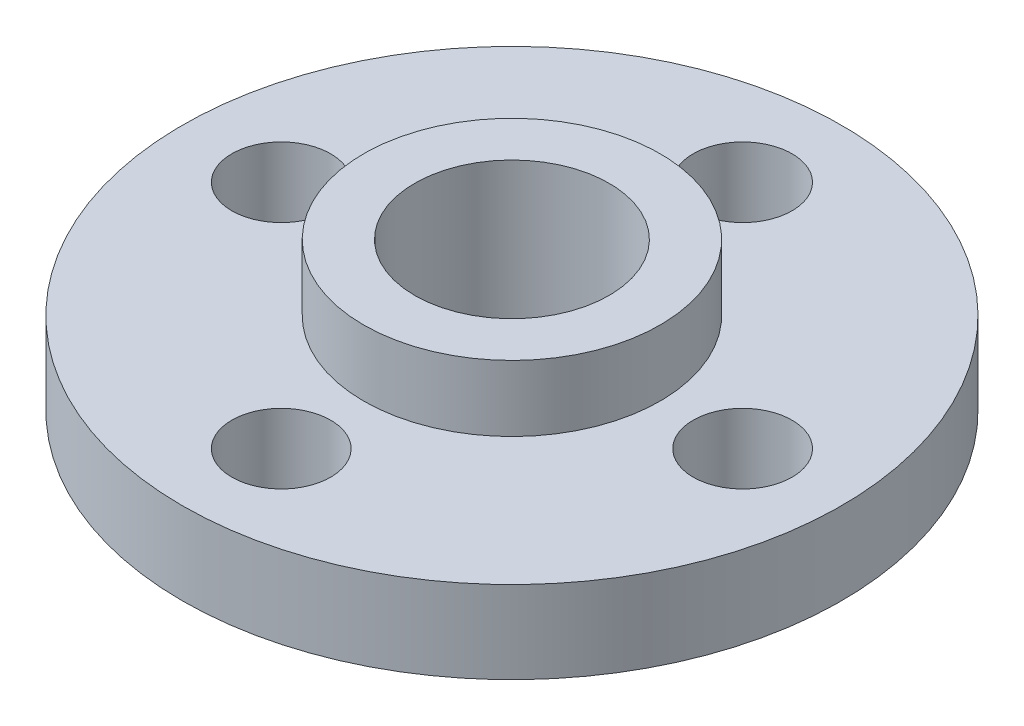
ISO-10303-21;
HEADER;
FILE_DESCRIPTION(('STEP AP214'),'2;1');
FILE_NAME('part.step','',(''),(''),'','','');
FILE_SCHEMA(('AUTOMOTIVE_DESIGN { 1 0 10303 214 1 1 1 1 }'));
ENDSEC;
DATA;
#1=APPLICATION_CONTEXT('core data for automotive mechanical design processes');
#2=APPLICATION_PROTOCOL_DEFINITION('international standard','automotive_design',2000,#1);
#3=PRODUCT_CONTEXT('',#1,'mechanical');
#4=PRODUCT('Part','Part','',(#3));
#5=PRODUCT_RELATED_PRODUCT_CATEGORY('part','',(#4));
#6=PRODUCT_DEFINITION_FORMATION('','',#4);
#7=PRODUCT_DEFINITION_CONTEXT('part definition',#1,'design');
#8=PRODUCT_DEFINITION('design','',#6,#7);
#9=PRODUCT_DEFINITION_SHAPE('','',#8);
#10=(LENGTH_UNIT() NAMED_UNIT(*) SI_UNIT(.MILLI.,.METRE.));
#11=(NAMED_UNIT(*) PLANE_ANGLE_UNIT() SI_UNIT($,.RADIAN.));
#12=(NAMED_UNIT(*) SI_UNIT($,.STERADIAN.) SOLID_ANGLE_UNIT());
#13=UNCERTAINTY_MEASURE_WITH_UNIT(LENGTH_MEASURE(1.E-05),#10,'distance_accuracy_value','');
#14=(GEOMETRIC_REPRESENTATION_CONTEXT(3) GLOBAL_UNCERTAINTY_ASSIGNED_CONTEXT((#13)) GLOBAL_UNIT_ASSIGNED_CONTEXT((#10,
#11,#12)) REPRESENTATION_CONTEXT('',''));
#15=CARTESIAN_POINT('',(0.,0.,0.));
#16=DIRECTION('',(0.,0.,1.));
#17=DIRECTION('',(1.,0.,0.));
#18=AXIS2_PLACEMENT_3D('',#15,#16,#17);
#19=CARTESIAN_POINT('',(0.,2.5,0.));
#20=DIRECTION('',(0.,1.,0.));
#21=DIRECTION('',(0.,0.,1.));
#22=AXIS2_PLACEMENT_3D('',#19,#20,#21);
#23=PLANE('',#22);
#24=CARTESIAN_POINT('',(0.,2.5,7.));
#25=DIRECTION('',(0.,1.,0.));
#26=DIRECTION('',(0.,0.,1.));
#27=AXIS2_PLACEMENT_3D('',#24,#25,#26);
#28=CIRCLE('',#27,1.5);
#29=CARTESIAN_POINT('',(0.,2.5,8.5));
#30=VERTEX_POINT('',#29);
#31=EDGE_CURVE('E54',#30,#30,#28,.T.);
#32=ORIENTED_EDGE('',*,*,#31,.F.);
#33=EDGE_LOOP('',(#32));
#34=FACE_BOUND('',#33,.T.);
#35=CARTESIAN_POINT('',(-7.,2.5,0.));
#36=DIRECTION('',(0.,1.,0.));
#37=DIRECTION('',(0.,0.,1.));
#38=AXIS2_PLACEMENT_3D('',#35,#36,#37);
#39=CIRCLE('',#38,1.5);
#40=CARTESIAN_POINT('',(-7.,2.5,1.5));
#41=VERTEX_POINT('',#40);
#42=EDGE_CURVE('E43',#41,#41,#39,.T.);
#43=ORIENTED_EDGE('',*,*,#42,.F.);
#44=EDGE_LOOP('',(#43));
#45=FACE_BOUND('',#44,.T.);
#46=CARTESIAN_POINT('',(0.,2.5,0.));
#47=DIRECTION('',(0.,1.,0.));
#48=DIRECTION('',(0.,0.,1.));
#49=AXIS2_PLACEMENT_3D('',#46,#47,#48);
#50=CIRCLE('',#49,10.);
#51=CARTESIAN_POINT('',(0.,2.5,10.));
#52=VERTEX_POINT('',#51);
#53=EDGE_CURVE('E10',#52,#52,#50,.T.);
#54=ORIENTED_EDGE('',*,*,#53,.T.);
#55=EDGE_LOOP('',(#54));
#56=FACE_BOUND('',#55,.T.);
#57=CARTESIAN_POINT('',(0.,2.5,-7.));
#58=DIRECTION('',(0.,1.,0.));
#59=DIRECTION('',(0.,0.,1.));
#60=AXIS2_PLACEMENT_3D('',#57,#58,#59);
#61=CIRCLE('',#60,1.5);
#62=CARTESIAN_POINT('',(0.,2.5,-5.5));
#63=VERTEX_POINT('',#62);
#64=EDGE_CURVE('E48',#63,#63,#61,.T.);
#65=ORIENTED_EDGE('',*,*,#64,.F.);
#66=EDGE_LOOP('',(#65));
#67=FACE_BOUND('',#66,.T.);
#68=CARTESIAN_POINT('',(7.,2.5,0.));
#69=DIRECTION('',(0.,1.,0.));
#70=DIRECTION('',(0.,0.,1.));
#71=AXIS2_PLACEMENT_3D('',#68,#69,#70);
#72=CIRCLE('',#71,1.5);
#73=CARTESIAN_POINT('',(7.,2.5,1.5));
#74=VERTEX_POINT('',#73);
#75=EDGE_CURVE('E60',#74,#74,#72,.T.);
#76=ORIENTED_EDGE('',*,*,#75,.F.);
#77=EDGE_LOOP('',(#76));
#78=FACE_BOUND('',#77,.T.);
#79=CARTESIAN_POINT('',(0.,2.5,0.));
#80=DIRECTION('',(0.,1.,0.));
#81=DIRECTION('',(0.,0.,1.));
#82=AXIS2_PLACEMENT_3D('',#79,#80,#81);
#83=CIRCLE('',#82,4.5);
#84=CARTESIAN_POINT('',(0.,2.5,4.5));
#85=VERTEX_POINT('',#84);
#86=EDGE_CURVE('E72',#85,#85,#83,.T.);
#87=ORIENTED_EDGE('',*,*,#86,.F.);
#88=EDGE_LOOP('',(#87));
#89=FACE_BOUND('',#88,.T.);
#90=ADVANCED_FACE('F32',(#34,#45,#56,#67,#78,#89),#23,.T.);
#91=CARTESIAN_POINT('',(0.,0.,0.));
#92=DIRECTION('',(0.,1.,0.));
#93=DIRECTION('',(0.,0.,1.));
#94=AXIS2_PLACEMENT_3D('',#91,#92,#93);
#95=PLANE('',#94);
#96=CARTESIAN_POINT('',(0.,0.,0.));
#97=DIRECTION('',(0.,1.,0.));
#98=DIRECTION('',(0.,0.,1.));
#99=AXIS2_PLACEMENT_3D('',#96,#97,#98);
#100=CIRCLE('',#99,10.);
#101=CARTESIAN_POINT('',(0.,0.,10.));
#102=VERTEX_POINT('',#101);
#103=EDGE_CURVE('E36',#102,#102,#100,.T.);
#104=ORIENTED_EDGE('',*,*,#103,.F.);
#105=EDGE_LOOP('',(#104));
#106=FACE_BOUND('',#105,.T.);
#107=CARTESIAN_POINT('',(-7.,0.,0.));
#108=DIRECTION('',(0.,1.,0.));
#109=DIRECTION('',(0.,0.,1.));
#110=AXIS2_PLACEMENT_3D('',#107,#108,#109);
#111=CIRCLE('',#110,1.5);
#112=CARTESIAN_POINT('',(-7.,0.,1.5));
#113=VERTEX_POINT('',#112);
#114=EDGE_CURVE('E45',#113,#113,#111,.T.);
#115=ORIENTED_EDGE('',*,*,#114,.T.);
#116=EDGE_LOOP('',(#115));
#117=FACE_BOUND('',#116,.T.);
#118=CARTESIAN_POINT('',(0.,0.,-7.));
#119=DIRECTION('',(0.,1.,0.));
#120=DIRECTION('',(0.,0.,1.));
#121=AXIS2_PLACEMENT_3D('',#118,#119,#120);
#122=CIRCLE('',#121,1.5);
#123=CARTESIAN_POINT('',(0.,0.,-5.5));
#124=VERTEX_POINT('',#123);
#125=EDGE_CURVE('E51',#124,#124,#122,.T.);
#126=ORIENTED_EDGE('',*,*,#125,.T.);
#127=EDGE_LOOP('',(#126));
#128=FACE_BOUND('',#127,.T.);
#129=CARTESIAN_POINT('',(0.,0.,7.));
#130=DIRECTION('',(0.,1.,0.));
#131=DIRECTION('',(0.,0.,1.));
#132=AXIS2_PLACEMENT_3D('',#129,#130,#131);
#133=CIRCLE('',#132,1.5);
#134=CARTESIAN_POINT('',(0.,0.,8.5));
#135=VERTEX_POINT('',#134);
#136=EDGE_CURVE('E57',#135,#135,#133,.T.);
#137=ORIENTED_EDGE('',*,*,#136,.T.);
#138=EDGE_LOOP('',(#137));
#139=FACE_BOUND('',#138,.T.);
#140=CARTESIAN_POINT('',(7.,0.,0.));
#141=DIRECTION('',(0.,1.,0.));
#142=DIRECTION('',(0.,0.,1.));
#143=AXIS2_PLACEMENT_3D('',#140,#141,#142);
#144=CIRCLE('',#143,1.5);
#145=CARTESIAN_POINT('',(7.,0.,1.5));
#146=VERTEX_POINT('',#145);
#147=EDGE_CURVE('E63',#146,#146,#144,.T.);
#148=ORIENTED_EDGE('',*,*,#147,.T.);
#149=EDGE_LOOP('',(#148));
#150=FACE_BOUND('',#149,.T.);
#151=CARTESIAN_POINT('',(0.,0.,0.));
#152=DIRECTION('',(0.,1.,0.));
#153=DIRECTION('',(0.,0.,1.));
#154=AXIS2_PLACEMENT_3D('',#151,#152,#153);
#155=CIRCLE('',#154,2.95);
#156=CARTESIAN_POINT('',(0.,0.,2.95));
#157=VERTEX_POINT('',#156);
#158=EDGE_CURVE('E66',#157,#157,#155,.T.);
#159=ORIENTED_EDGE('',*,*,#158,.T.);
#160=EDGE_LOOP('',(#159));
#161=FACE_BOUND('',#160,.T.);
#162=ADVANCED_FACE('F98',(#106,#117,#128,#139,#150,#161),#95,.F.);
#163=CARTESIAN_POINT('',(0.,2.5,0.));
#164=DIRECTION('',(0.,-1.,0.));
#165=DIRECTION('',(0.,0.,-1.));
#166=AXIS2_PLACEMENT_3D('',#163,#164,#165);
#167=CYLINDRICAL_SURFACE('',#166,10.);
#168=ORIENTED_EDGE('',*,*,#53,.F.);
#169=EDGE_LOOP('',(#168));
#170=FACE_BOUND('',#169,.T.);
#171=ORIENTED_EDGE('',*,*,#103,.T.);
#172=EDGE_LOOP('',(#171));
#173=FACE_BOUND('',#172,.T.);
#174=ADVANCED_FACE('F34',(#170,#173),#167,.T.);
#175=CARTESIAN_POINT('',(-7.,2.5,0.));
#176=DIRECTION('',(0.,-1.,0.));
#177=DIRECTION('',(0.,0.,-1.));
#178=AXIS2_PLACEMENT_3D('',#175,#176,#177);
#179=CYLINDRICAL_SURFACE('',#178,1.5);
#180=ORIENTED_EDGE('',*,*,#42,.T.);
#181=EDGE_LOOP('',(#180));
#182=FACE_BOUND('',#181,.T.);
#183=ORIENTED_EDGE('',*,*,#114,.F.);
#184=EDGE_LOOP('',(#183));
#185=FACE_BOUND('',#184,.T.);
#186=ADVANCED_FACE('F108',(#182,#185),#179,.F.);
#187=CARTESIAN_POINT('',(0.,2.5,-7.));
#188=DIRECTION('',(0.,-1.,0.));
#189=DIRECTION('',(0.,0.,-1.));
#190=AXIS2_PLACEMENT_3D('',#187,#188,#189);
#191=CYLINDRICAL_SURFACE('',#190,1.5);
#192=ORIENTED_EDGE('',*,*,#64,.T.);
#193=EDGE_LOOP('',(#192));
#194=FACE_BOUND('',#193,.T.);
#195=ORIENTED_EDGE('',*,*,#125,.F.);
#196=EDGE_LOOP('',(#195));
#197=FACE_BOUND('',#196,.T.);
#198=ADVANCED_FACE('F111',(#194,#197),#191,.F.);
#199=CARTESIAN_POINT('',(0.,2.5,7.));
#200=DIRECTION('',(0.,-1.,0.));
#201=DIRECTION('',(0.,0.,-1.));
#202=AXIS2_PLACEMENT_3D('',#199,#200,#201);
#203=CYLINDRICAL_SURFACE('',#202,1.5);
#204=ORIENTED_EDGE('',*,*,#31,.T.);
#205=EDGE_LOOP('',(#204));
#206=FACE_BOUND('',#205,.T.);
#207=ORIENTED_EDGE('',*,*,#136,.F.);
#208=EDGE_LOOP('',(#207));
#209=FACE_BOUND('',#208,.T.);
#210=ADVANCED_FACE('F115',(#206,#209),#203,.F.);
#211=CARTESIAN_POINT('',(7.,2.5,0.));
#212=DIRECTION('',(0.,-1.,0.));
#213=DIRECTION('',(0.,0.,-1.));
#214=AXIS2_PLACEMENT_3D('',#211,#212,#213);
#215=CYLINDRICAL_SURFACE('',#214,1.5);
#216=ORIENTED_EDGE('',*,*,#75,.T.);
#217=EDGE_LOOP('',(#216));
#218=FACE_BOUND('',#217,.T.);
#219=ORIENTED_EDGE('',*,*,#147,.F.);
#220=EDGE_LOOP('',(#219));
#221=FACE_BOUND('',#220,.T.);
#222=ADVANCED_FACE('F94',(#218,#221),#215,.F.);
#223=CARTESIAN_POINT('',(0.,2.5,0.));
#224=DIRECTION('',(0.,-1.,0.));
#225=DIRECTION('',(0.,0.,-1.));
#226=AXIS2_PLACEMENT_3D('',#223,#224,#225);
#227=CYLINDRICAL_SURFACE('',#226,2.95);
#228=ORIENTED_EDGE('',*,*,#158,.F.);
#229=EDGE_LOOP('',(#228));
#230=FACE_BOUND('',#229,.T.);
#231=CARTESIAN_POINT('',(0.,4.5,0.));
#232=DIRECTION('',(0.,1.,0.));
#233=DIRECTION('',(0.,0.,1.));
#234=AXIS2_PLACEMENT_3D('',#231,#232,#233);
#235=CIRCLE('',#234,2.95);
#236=CARTESIAN_POINT('',(0.,4.5,2.95));
#237=VERTEX_POINT('',#236);
#238=EDGE_CURVE('E75',#237,#237,#235,.T.);
#239=ORIENTED_EDGE('',*,*,#238,.T.);
#240=EDGE_LOOP('',(#239));
#241=FACE_BOUND('',#240,.T.);
#242=ADVANCED_FACE('F81',(#230,#241),#227,.F.);
#243=CARTESIAN_POINT('',(0.,4.5,0.));
#244=DIRECTION('',(0.,1.,0.));
#245=DIRECTION('',(0.,0.,1.));
#246=AXIS2_PLACEMENT_3D('',#243,#244,#245);
#247=PLANE('',#246);
#248=CARTESIAN_POINT('',(0.,4.5,0.));
#249=DIRECTION('',(0.,1.,0.));
#250=DIRECTION('',(0.,0.,1.));
#251=AXIS2_PLACEMENT_3D('',#248,#249,#250);
#252=CIRCLE('',#251,4.5);
#253=CARTESIAN_POINT('',(0.,4.5,4.5));
#254=VERTEX_POINT('',#253);
#255=EDGE_CURVE('E71',#254,#254,#252,.T.);
#256=ORIENTED_EDGE('',*,*,#255,.T.);
#257=EDGE_LOOP('',(#256));
#258=FACE_BOUND('',#257,.T.);
#259=ORIENTED_EDGE('',*,*,#238,.F.);
#260=EDGE_LOOP('',(#259));
#261=FACE_BOUND('',#260,.T.);
#262=ADVANCED_FACE('F83',(#258,#261),#247,.T.);
#263=CARTESIAN_POINT('',(0.,4.5,0.));
#264=DIRECTION('',(0.,-1.,0.));
#265=DIRECTION('',(0.,0.,-1.));
#266=AXIS2_PLACEMENT_3D('',#263,#264,#265);
#267=CYLINDRICAL_SURFACE('',#266,4.5);
#268=ORIENTED_EDGE('',*,*,#255,.F.);
#269=EDGE_LOOP('',(#268));
#270=FACE_BOUND('',#269,.T.);
#271=ORIENTED_EDGE('',*,*,#86,.T.);
#272=EDGE_LOOP('',(#271));
#273=FACE_BOUND('',#272,.T.);
#274=ADVANCED_FACE('F85',(#270,#273),#267,.T.);
#275=CLOSED_SHELL('',(#90,#162,#174,#186,#198,#210,#222,#242,#262,#274));
#276=MANIFOLD_SOLID_BREP('B2',#275);
#277=ADVANCED_BREP_SHAPE_REPRESENTATION('',(#18,#276),#14);
#278=SHAPE_DEFINITION_REPRESENTATION(#9,#277);
ENDSEC;
END-ISO-10303-21;
